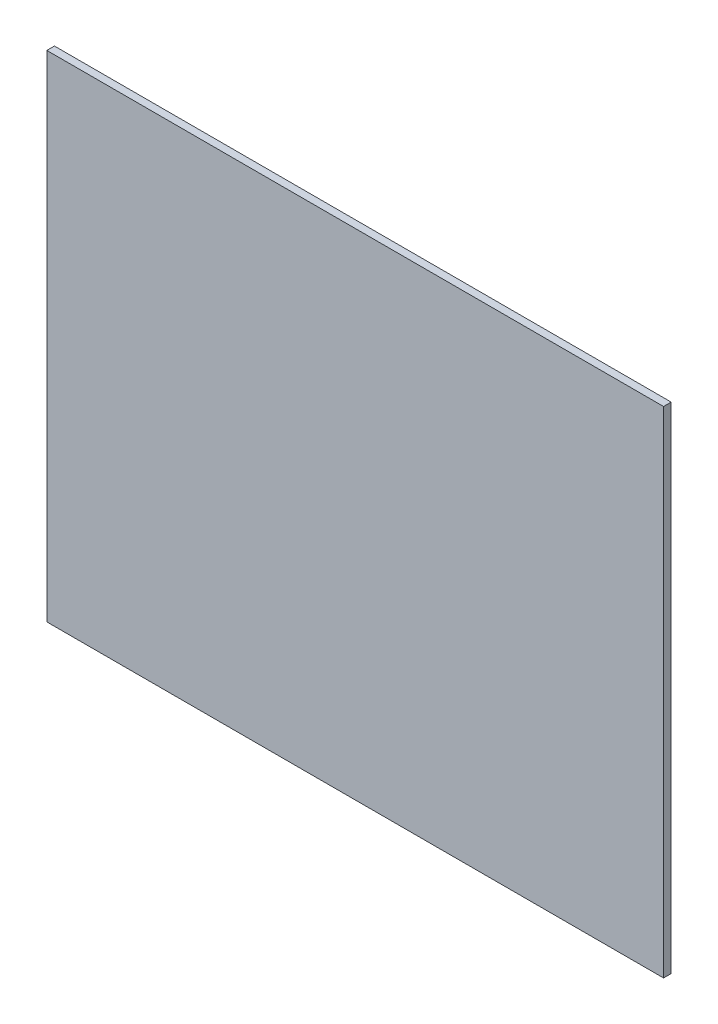
ISO-10303-21;
HEADER;
FILE_DESCRIPTION(('STEP AP214'),'2;1');
FILE_NAME('part.step','',(''),(''),'','','');
FILE_SCHEMA(('AUTOMOTIVE_DESIGN { 1 0 10303 214 1 1 1 1 }'));
ENDSEC;
DATA;
#1=APPLICATION_CONTEXT('core data for automotive mechanical design processes');
#2=APPLICATION_PROTOCOL_DEFINITION('international standard','automotive_design',2000,#1);
#3=PRODUCT_CONTEXT('',#1,'mechanical');
#4=PRODUCT('Part','Part','',(#3));
#5=PRODUCT_RELATED_PRODUCT_CATEGORY('part','',(#4));
#6=PRODUCT_DEFINITION_FORMATION('','',#4);
#7=PRODUCT_DEFINITION_CONTEXT('part definition',#1,'design');
#8=PRODUCT_DEFINITION('design','',#6,#7);
#9=PRODUCT_DEFINITION_SHAPE('','',#8);
#10=(LENGTH_UNIT() NAMED_UNIT(*) SI_UNIT(.MILLI.,.METRE.));
#11=(NAMED_UNIT(*) PLANE_ANGLE_UNIT() SI_UNIT($,.RADIAN.));
#12=(NAMED_UNIT(*) SI_UNIT($,.STERADIAN.) SOLID_ANGLE_UNIT());
#13=UNCERTAINTY_MEASURE_WITH_UNIT(LENGTH_MEASURE(1.E-05),#10,'distance_accuracy_value','');
#14=(GEOMETRIC_REPRESENTATION_CONTEXT(3) GLOBAL_UNCERTAINTY_ASSIGNED_CONTEXT((#13)) GLOBAL_UNIT_ASSIGNED_CONTEXT((#10,
#11,#12)) REPRESENTATION_CONTEXT('',''));
#15=CARTESIAN_POINT('',(0.,0.,0.));
#16=DIRECTION('',(0.,0.,1.));
#17=DIRECTION('',(1.,0.,0.));
#18=AXIS2_PLACEMENT_3D('',#15,#16,#17);
#19=CARTESIAN_POINT('',(4.05,0.1,0.05));
#20=DIRECTION('',(-1.,0.,0.));
#21=DIRECTION('',(0.,0.,1.));
#22=AXIS2_PLACEMENT_3D('',#19,#20,#21);
#23=PLANE('',#22);
#24=DIRECTION('',(0.,0.,-1.));
#25=VECTOR('',#24,1.);
#26=CARTESIAN_POINT('',(4.05,-3.15,0.05));
#27=LINE('',#26,#25);
#28=CARTESIAN_POINT('',(4.05,-3.15,0.1));
#29=VERTEX_POINT('',#28);
#30=CARTESIAN_POINT('',(4.05,-3.15,0.));
#31=VERTEX_POINT('',#30);
#32=EDGE_CURVE('E85',#29,#31,#27,.T.);
#33=ORIENTED_EDGE('',*,*,#32,.T.);
#34=DIRECTION('',(0.,-1.,0.));
#35=VECTOR('',#34,1.);
#36=CARTESIAN_POINT('',(4.05,0.1,0.));
#37=LINE('',#36,#35);
#38=CARTESIAN_POINT('',(4.05,3.35,0.));
#39=VERTEX_POINT('',#38);
#40=EDGE_CURVE('E81',#39,#31,#37,.T.);
#41=ORIENTED_EDGE('',*,*,#40,.F.);
#42=DIRECTION('',(0.,0.,-1.));
#43=VECTOR('',#42,1.);
#44=CARTESIAN_POINT('',(4.05,3.35,0.05));
#45=LINE('',#44,#43);
#46=CARTESIAN_POINT('',(4.05,3.35,0.1));
#47=VERTEX_POINT('',#46);
#48=EDGE_CURVE('E11',#47,#39,#45,.T.);
#49=ORIENTED_EDGE('',*,*,#48,.F.);
#50=DIRECTION('',(0.,1.,0.));
#51=VECTOR('',#50,1.);
#52=CARTESIAN_POINT('',(4.05,0.1,0.1));
#53=LINE('',#52,#51);
#54=EDGE_CURVE('E107',#29,#47,#53,.T.);
#55=ORIENTED_EDGE('',*,*,#54,.F.);
#56=EDGE_LOOP('',(#33,#41,#49,#55));
#57=FACE_BOUND('',#56,.T.);
#58=ADVANCED_FACE('F16',(#57),#23,.F.);
#59=CARTESIAN_POINT('',(0.,3.35,0.05));
#60=DIRECTION('',(0.,-1.,0.));
#61=DIRECTION('',(0.,0.,-1.));
#62=AXIS2_PLACEMENT_3D('',#59,#60,#61);
#63=PLANE('',#62);
#64=ORIENTED_EDGE('',*,*,#48,.T.);
#65=DIRECTION('',(1.,0.,0.));
#66=VECTOR('',#65,1.);
#67=CARTESIAN_POINT('',(0.,3.35,0.));
#68=LINE('',#67,#66);
#69=CARTESIAN_POINT('',(-4.05,3.35,0.));
#70=VERTEX_POINT('',#69);
#71=EDGE_CURVE('E69',#70,#39,#68,.T.);
#72=ORIENTED_EDGE('',*,*,#71,.F.);
#73=DIRECTION('',(0.,0.,-1.));
#74=VECTOR('',#73,1.);
#75=CARTESIAN_POINT('',(-4.05,3.35,0.05));
#76=LINE('',#75,#74);
#77=CARTESIAN_POINT('',(-4.05,3.35,0.1));
#78=VERTEX_POINT('',#77);
#79=EDGE_CURVE('E19',#78,#70,#76,.T.);
#80=ORIENTED_EDGE('',*,*,#79,.F.);
#81=DIRECTION('',(-1.,0.,0.));
#82=VECTOR('',#81,1.);
#83=CARTESIAN_POINT('',(0.,3.35,0.1));
#84=LINE('',#83,#82);
#85=EDGE_CURVE('E72',#47,#78,#84,.T.);
#86=ORIENTED_EDGE('',*,*,#85,.F.);
#87=EDGE_LOOP('',(#64,#72,#80,#86));
#88=FACE_BOUND('',#87,.T.);
#89=ADVANCED_FACE('F68',(#88),#63,.F.);
#90=CARTESIAN_POINT('',(-4.05,0.1,0.05));
#91=DIRECTION('',(1.,0.,0.));
#92=DIRECTION('',(0.,1.,0.));
#93=AXIS2_PLACEMENT_3D('',#90,#91,#92);
#94=PLANE('',#93);
#95=ORIENTED_EDGE('',*,*,#79,.T.);
#96=DIRECTION('',(0.,1.,0.));
#97=VECTOR('',#96,1.);
#98=CARTESIAN_POINT('',(-4.05,0.1,0.));
#99=LINE('',#98,#97);
#100=CARTESIAN_POINT('',(-4.05,-3.15,0.));
#101=VERTEX_POINT('',#100);
#102=EDGE_CURVE('E82',#101,#70,#99,.T.);
#103=ORIENTED_EDGE('',*,*,#102,.F.);
#104=DIRECTION('',(0.,0.,-1.));
#105=VECTOR('',#104,1.);
#106=CARTESIAN_POINT('',(-4.05,-3.15,0.05));
#107=LINE('',#106,#105);
#108=CARTESIAN_POINT('',(-4.05,-3.15,0.1));
#109=VERTEX_POINT('',#108);
#110=EDGE_CURVE('E61',#109,#101,#107,.T.);
#111=ORIENTED_EDGE('',*,*,#110,.F.);
#112=DIRECTION('',(0.,-1.,0.));
#113=VECTOR('',#112,1.);
#114=CARTESIAN_POINT('',(-4.05,0.1,0.1));
#115=LINE('',#114,#113);
#116=EDGE_CURVE('E98',#78,#109,#115,.T.);
#117=ORIENTED_EDGE('',*,*,#116,.F.);
#118=EDGE_LOOP('',(#95,#103,#111,#117));
#119=FACE_BOUND('',#118,.T.);
#120=ADVANCED_FACE('F119',(#119),#94,.F.);
#121=CARTESIAN_POINT('',(0.,-3.15,0.05));
#122=DIRECTION('',(0.,1.,0.));
#123=DIRECTION('',(1.,0.,0.));
#124=AXIS2_PLACEMENT_3D('',#121,#122,#123);
#125=PLANE('',#124);
#126=ORIENTED_EDGE('',*,*,#110,.T.);
#127=DIRECTION('',(-1.,0.,0.));
#128=VECTOR('',#127,1.);
#129=CARTESIAN_POINT('',(0.,-3.15,0.));
#130=LINE('',#129,#128);
#131=EDGE_CURVE('E88',#31,#101,#130,.T.);
#132=ORIENTED_EDGE('',*,*,#131,.F.);
#133=ORIENTED_EDGE('',*,*,#32,.F.);
#134=DIRECTION('',(1.,0.,0.));
#135=VECTOR('',#134,1.);
#136=CARTESIAN_POINT('',(0.,-3.15,0.1));
#137=LINE('',#136,#135);
#138=EDGE_CURVE('E89',#109,#29,#137,.T.);
#139=ORIENTED_EDGE('',*,*,#138,.F.);
#140=EDGE_LOOP('',(#126,#132,#133,#139));
#141=FACE_BOUND('',#140,.T.);
#142=ADVANCED_FACE('F118',(#141),#125,.F.);
#143=CARTESIAN_POINT('',(0.,0.1,0.));
#144=DIRECTION('',(0.,0.,1.));
#145=DIRECTION('',(1.,0.,0.));
#146=AXIS2_PLACEMENT_3D('',#143,#144,#145);
#147=PLANE('',#146);
#148=ORIENTED_EDGE('',*,*,#40,.T.);
#149=ORIENTED_EDGE('',*,*,#131,.T.);
#150=ORIENTED_EDGE('',*,*,#102,.T.);
#151=ORIENTED_EDGE('',*,*,#71,.T.);
#152=EDGE_LOOP('',(#148,#149,#150,#151));
#153=FACE_BOUND('',#152,.T.);
#154=ADVANCED_FACE('F79',(#153),#147,.F.);
#155=CARTESIAN_POINT('',(0.,0.1,0.1));
#156=DIRECTION('',(0.,0.,1.));
#157=DIRECTION('',(1.,0.,0.));
#158=AXIS2_PLACEMENT_3D('',#155,#156,#157);
#159=PLANE('',#158);
#160=ORIENTED_EDGE('',*,*,#54,.T.);
#161=ORIENTED_EDGE('',*,*,#85,.T.);
#162=ORIENTED_EDGE('',*,*,#116,.T.);
#163=ORIENTED_EDGE('',*,*,#138,.T.);
#164=EDGE_LOOP('',(#160,#161,#162,#163));
#165=FACE_BOUND('',#164,.T.);
#166=ADVANCED_FACE('F116',(#165),#159,.T.);
#167=CLOSED_SHELL('',(#58,#89,#120,#142,#154,#166));
#168=MANIFOLD_SOLID_BREP('B1',#167);
#169=ADVANCED_BREP_SHAPE_REPRESENTATION('',(#18,#168),#14);
#170=SHAPE_DEFINITION_REPRESENTATION(#9,#169);
ENDSEC;
END-ISO-10303-21;
